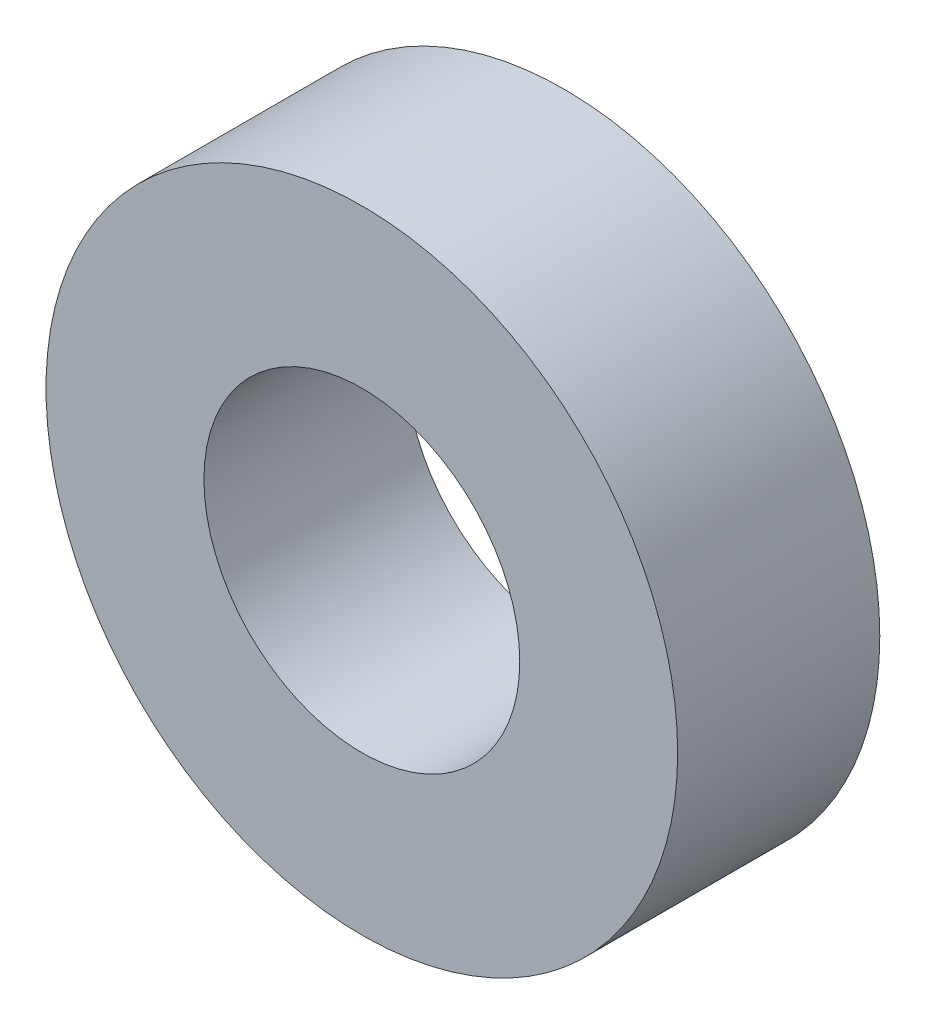
ISO-10303-21;
HEADER;
FILE_DESCRIPTION(('STEP AP214'),'2;1');
FILE_NAME('part.step','',(''),(''),'','','');
FILE_SCHEMA(('AUTOMOTIVE_DESIGN { 1 0 10303 214 1 1 1 1 }'));
ENDSEC;
DATA;
#1=APPLICATION_CONTEXT('core data for automotive mechanical design processes');
#2=APPLICATION_PROTOCOL_DEFINITION('international standard','automotive_design',2000,#1);
#3=PRODUCT_CONTEXT('',#1,'mechanical');
#4=PRODUCT('Part','Part','',(#3));
#5=PRODUCT_RELATED_PRODUCT_CATEGORY('part','',(#4));
#6=PRODUCT_DEFINITION_FORMATION('','',#4);
#7=PRODUCT_DEFINITION_CONTEXT('part definition',#1,'design');
#8=PRODUCT_DEFINITION('design','',#6,#7);
#9=PRODUCT_DEFINITION_SHAPE('','',#8);
#10=(LENGTH_UNIT() NAMED_UNIT(*) SI_UNIT(.MILLI.,.METRE.));
#11=(NAMED_UNIT(*) PLANE_ANGLE_UNIT() SI_UNIT($,.RADIAN.));
#12=(NAMED_UNIT(*) SI_UNIT($,.STERADIAN.) SOLID_ANGLE_UNIT());
#13=UNCERTAINTY_MEASURE_WITH_UNIT(LENGTH_MEASURE(1.E-05),#10,'distance_accuracy_value','');
#14=(GEOMETRIC_REPRESENTATION_CONTEXT(3) GLOBAL_UNCERTAINTY_ASSIGNED_CONTEXT((#13)) GLOBAL_UNIT_ASSIGNED_CONTEXT((#10,
#11,#12)) REPRESENTATION_CONTEXT('',''));
#15=CARTESIAN_POINT('',(0.,0.,0.));
#16=DIRECTION('',(0.,0.,1.));
#17=DIRECTION('',(1.,0.,0.));
#18=AXIS2_PLACEMENT_3D('',#15,#16,#17);
#19=CARTESIAN_POINT('',(0.,0.,8.));
#20=DIRECTION('',(0.,0.,1.));
#21=DIRECTION('',(1.,0.,0.));
#22=AXIS2_PLACEMENT_3D('',#19,#20,#21);
#23=PLANE('',#22);
#24=CARTESIAN_POINT('',(0.,0.,8.));
#25=DIRECTION('',(0.,0.,1.));
#26=DIRECTION('',(1.,0.,0.));
#27=AXIS2_PLACEMENT_3D('',#24,#25,#26);
#28=CIRCLE('',#27,12.5);
#29=CARTESIAN_POINT('',(12.5,0.,8.));
#30=VERTEX_POINT('',#29);
#31=EDGE_CURVE('E10',#30,#30,#28,.T.);
#32=ORIENTED_EDGE('',*,*,#31,.T.);
#33=EDGE_LOOP('',(#32));
#34=FACE_BOUND('',#33,.T.);
#35=CARTESIAN_POINT('',(0.,0.,8.));
#36=DIRECTION('',(0.,0.,1.));
#37=DIRECTION('',(1.,0.,0.));
#38=AXIS2_PLACEMENT_3D('',#35,#36,#37);
#39=CIRCLE('',#38,6.25);
#40=CARTESIAN_POINT('',(6.25,0.,8.));
#41=VERTEX_POINT('',#40);
#42=EDGE_CURVE('E46',#41,#41,#39,.T.);
#43=ORIENTED_EDGE('',*,*,#42,.F.);
#44=EDGE_LOOP('',(#43));
#45=FACE_BOUND('',#44,.T.);
#46=ADVANCED_FACE('F35',(#34,#45),#23,.T.);
#47=CARTESIAN_POINT('',(0.,0.,0.));
#48=DIRECTION('',(0.,0.,1.));
#49=DIRECTION('',(1.,0.,0.));
#50=AXIS2_PLACEMENT_3D('',#47,#48,#49);
#51=PLANE('',#50);
#52=CARTESIAN_POINT('',(0.,0.,0.));
#53=DIRECTION('',(0.,0.,1.));
#54=DIRECTION('',(1.,0.,0.));
#55=AXIS2_PLACEMENT_3D('',#52,#53,#54);
#56=CIRCLE('',#55,12.5);
#57=CARTESIAN_POINT('',(12.5,0.,0.));
#58=VERTEX_POINT('',#57);
#59=EDGE_CURVE('E39',#58,#58,#56,.T.);
#60=ORIENTED_EDGE('',*,*,#59,.F.);
#61=EDGE_LOOP('',(#60));
#62=FACE_BOUND('',#61,.T.);
#63=CARTESIAN_POINT('',(0.,0.,0.));
#64=DIRECTION('',(0.,0.,1.));
#65=DIRECTION('',(1.,0.,0.));
#66=AXIS2_PLACEMENT_3D('',#63,#64,#65);
#67=CIRCLE('',#66,6.25);
#68=CARTESIAN_POINT('',(6.25,0.,0.));
#69=VERTEX_POINT('',#68);
#70=EDGE_CURVE('E48',#69,#69,#67,.T.);
#71=ORIENTED_EDGE('',*,*,#70,.T.);
#72=EDGE_LOOP('',(#71));
#73=FACE_BOUND('',#72,.T.);
#74=ADVANCED_FACE('F58',(#62,#73),#51,.F.);
#75=CARTESIAN_POINT('',(0.,0.,8.));
#76=DIRECTION('',(0.,0.,-1.));
#77=DIRECTION('',(-1.,0.,0.));
#78=AXIS2_PLACEMENT_3D('',#75,#76,#77);
#79=CYLINDRICAL_SURFACE('',#78,12.5);
#80=ORIENTED_EDGE('',*,*,#31,.F.);
#81=EDGE_LOOP('',(#80));
#82=FACE_BOUND('',#81,.T.);
#83=ORIENTED_EDGE('',*,*,#59,.T.);
#84=EDGE_LOOP('',(#83));
#85=FACE_BOUND('',#84,.T.);
#86=ADVANCED_FACE('F37',(#82,#85),#79,.T.);
#87=CARTESIAN_POINT('',(0.,0.,8.));
#88=DIRECTION('',(0.,0.,-1.));
#89=DIRECTION('',(-1.,0.,0.));
#90=AXIS2_PLACEMENT_3D('',#87,#88,#89);
#91=CYLINDRICAL_SURFACE('',#90,6.25);
#92=ORIENTED_EDGE('',*,*,#42,.T.);
#93=EDGE_LOOP('',(#92));
#94=FACE_BOUND('',#93,.T.);
#95=ORIENTED_EDGE('',*,*,#70,.F.);
#96=EDGE_LOOP('',(#95));
#97=FACE_BOUND('',#96,.T.);
#98=ADVANCED_FACE('F54',(#94,#97),#91,.F.);
#99=CLOSED_SHELL('',(#46,#74,#86,#98));
#100=MANIFOLD_SOLID_BREP('B2',#99);
#101=ADVANCED_BREP_SHAPE_REPRESENTATION('',(#18,#100),#14);
#102=SHAPE_DEFINITION_REPRESENTATION(#9,#101);
ENDSEC;
END-ISO-10303-21;
